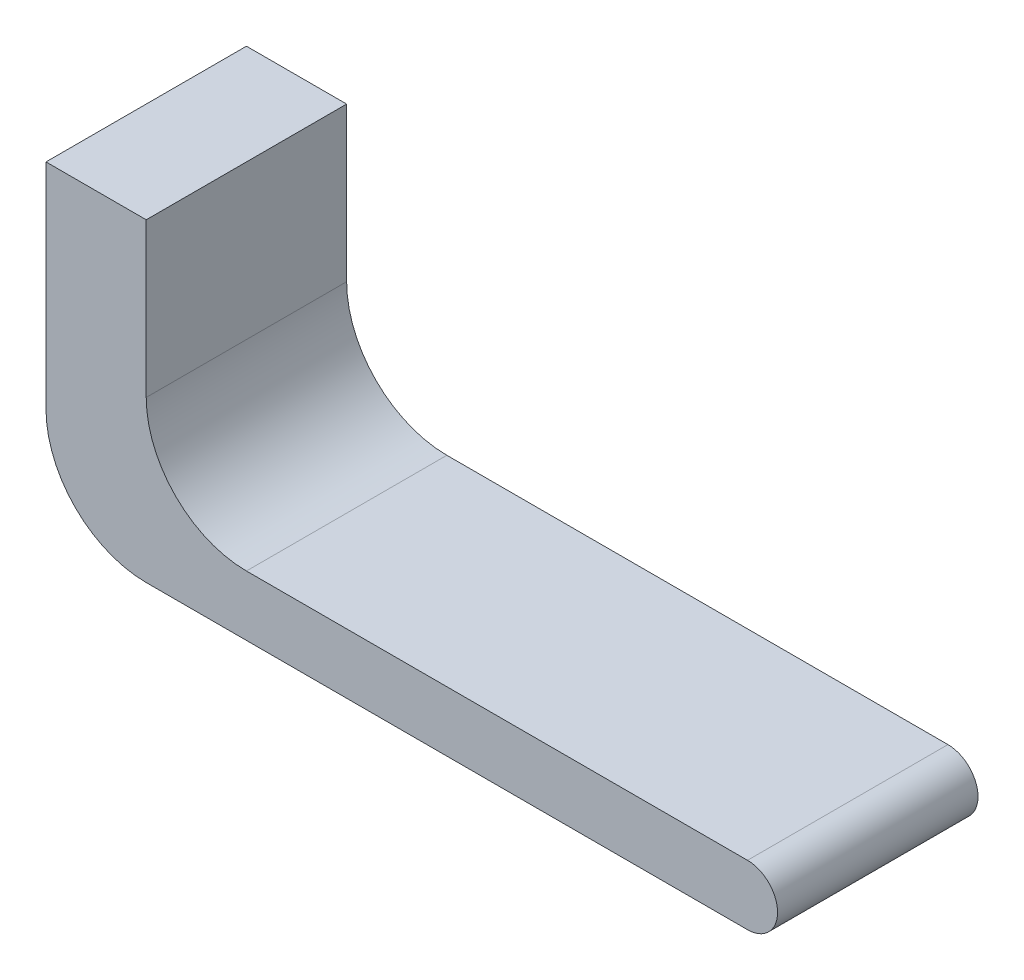
ISO-10303-21;
HEADER;
FILE_DESCRIPTION(('STEP AP214'),'2;1');
FILE_NAME('part.step','',(''),(''),'','','');
FILE_SCHEMA(('AUTOMOTIVE_DESIGN { 1 0 10303 214 1 1 1 1 }'));
ENDSEC;
DATA;
#1=APPLICATION_CONTEXT('core data for automotive mechanical design processes');
#2=APPLICATION_PROTOCOL_DEFINITION('international standard','automotive_design',2000,#1);
#3=PRODUCT_CONTEXT('',#1,'mechanical');
#4=PRODUCT('Part','Part','',(#3));
#5=PRODUCT_RELATED_PRODUCT_CATEGORY('part','',(#4));
#6=PRODUCT_DEFINITION_FORMATION('','',#4);
#7=PRODUCT_DEFINITION_CONTEXT('part definition',#1,'design');
#8=PRODUCT_DEFINITION('design','',#6,#7);
#9=PRODUCT_DEFINITION_SHAPE('','',#8);
#10=(LENGTH_UNIT() NAMED_UNIT(*) SI_UNIT(.MILLI.,.METRE.));
#11=(NAMED_UNIT(*) PLANE_ANGLE_UNIT() SI_UNIT($,.RADIAN.));
#12=(NAMED_UNIT(*) SI_UNIT($,.STERADIAN.) SOLID_ANGLE_UNIT());
#13=UNCERTAINTY_MEASURE_WITH_UNIT(LENGTH_MEASURE(1.E-05),#10,'distance_accuracy_value','');
#14=(GEOMETRIC_REPRESENTATION_CONTEXT(3) GLOBAL_UNCERTAINTY_ASSIGNED_CONTEXT((#13)) GLOBAL_UNIT_ASSIGNED_CONTEXT((#10,
#11,#12)) REPRESENTATION_CONTEXT('',''));
#15=CARTESIAN_POINT('',(0.,0.,0.));
#16=DIRECTION('',(0.,0.,1.));
#17=DIRECTION('',(1.,0.,0.));
#18=AXIS2_PLACEMENT_3D('',#15,#16,#17);
#19=CARTESIAN_POINT('',(0.,0.,10.));
#20=DIRECTION('',(0.,0.,-1.));
#21=DIRECTION('',(-1.,0.,0.));
#22=AXIS2_PLACEMENT_3D('',#19,#20,#21);
#23=CYLINDRICAL_SURFACE('',#22,1.5);
#24=CARTESIAN_POINT('',(0.,0.,0.));
#25=DIRECTION('',(0.,0.,1.));
#26=DIRECTION('',(1.,0.,0.));
#27=AXIS2_PLACEMENT_3D('',#24,#25,#26);
#28=CIRCLE('',#27,1.5);
#29=CARTESIAN_POINT('',(0.,-1.5,0.));
#30=VERTEX_POINT('',#29);
#31=CARTESIAN_POINT('',(0.,1.5,0.));
#32=VERTEX_POINT('',#31);
#33=EDGE_CURVE('E123',#30,#32,#28,.T.);
#34=ORIENTED_EDGE('',*,*,#33,.T.);
#35=DIRECTION('',(0.,0.,-1.));
#36=VECTOR('',#35,1.);
#37=CARTESIAN_POINT('',(0.,1.5,10.));
#38=LINE('',#37,#36);
#39=CARTESIAN_POINT('',(0.,1.5,10.));
#40=VERTEX_POINT('',#39);
#41=EDGE_CURVE('E104',#40,#32,#38,.T.);
#42=ORIENTED_EDGE('',*,*,#41,.F.);
#43=CARTESIAN_POINT('',(0.,0.,10.));
#44=DIRECTION('',(0.,0.,1.));
#45=DIRECTION('',(1.,0.,0.));
#46=AXIS2_PLACEMENT_3D('',#43,#44,#45);
#47=CIRCLE('',#46,1.5);
#48=CARTESIAN_POINT('',(0.,-1.5,10.));
#49=VERTEX_POINT('',#48);
#50=EDGE_CURVE('E111',#49,#40,#47,.T.);
#51=ORIENTED_EDGE('',*,*,#50,.F.);
#52=DIRECTION('',(0.,0.,-1.));
#53=VECTOR('',#52,1.);
#54=CARTESIAN_POINT('',(0.,-1.5,10.));
#55=LINE('',#54,#53);
#56=EDGE_CURVE('E140',#49,#30,#55,.T.);
#57=ORIENTED_EDGE('',*,*,#56,.T.);
#58=EDGE_LOOP('',(#34,#42,#51,#57));
#59=FACE_BOUND('',#58,.T.);
#60=ADVANCED_FACE('F35',(#59),#23,.T.);
#61=CARTESIAN_POINT('',(0.,1.5,10.));
#62=DIRECTION('',(0.,-1.,0.));
#63=DIRECTION('',(0.,0.,-1.));
#64=AXIS2_PLACEMENT_3D('',#61,#62,#63);
#65=PLANE('',#64);
#66=DIRECTION('',(-1.,0.,0.));
#67=VECTOR('',#66,1.);
#68=CARTESIAN_POINT('',(0.,1.5,0.));
#69=LINE('',#68,#67);
#70=CARTESIAN_POINT('',(-25.,1.5,0.));
#71=VERTEX_POINT('',#70);
#72=EDGE_CURVE('E151',#32,#71,#69,.T.);
#73=ORIENTED_EDGE('',*,*,#72,.T.);
#74=DIRECTION('',(0.,0.,-1.));
#75=VECTOR('',#74,1.);
#76=CARTESIAN_POINT('',(-25.,1.5,10.));
#77=LINE('',#76,#75);
#78=CARTESIAN_POINT('',(-25.,1.5,10.));
#79=VERTEX_POINT('',#78);
#80=EDGE_CURVE('E107',#79,#71,#77,.T.);
#81=ORIENTED_EDGE('',*,*,#80,.F.);
#82=DIRECTION('',(-1.,0.,0.));
#83=VECTOR('',#82,1.);
#84=CARTESIAN_POINT('',(0.,1.5,10.));
#85=LINE('',#84,#83);
#86=EDGE_CURVE('E100',#40,#79,#85,.T.);
#87=ORIENTED_EDGE('',*,*,#86,.F.);
#88=ORIENTED_EDGE('',*,*,#41,.T.);
#89=EDGE_LOOP('',(#73,#81,#87,#88));
#90=FACE_BOUND('',#89,.T.);
#91=ADVANCED_FACE('F102',(#90),#65,.F.);
#92=CARTESIAN_POINT('',(-25.,6.5,10.));
#93=DIRECTION('',(0.,0.,-1.));
#94=DIRECTION('',(-1.,0.,0.));
#95=AXIS2_PLACEMENT_3D('',#92,#93,#94);
#96=CYLINDRICAL_SURFACE('',#95,5.);
#97=CARTESIAN_POINT('',(-25.,6.5,0.));
#98=DIRECTION('',(0.,0.,-1.));
#99=DIRECTION('',(-1.,0.,0.));
#100=AXIS2_PLACEMENT_3D('',#97,#98,#99);
#101=CIRCLE('',#100,5.);
#102=CARTESIAN_POINT('',(-30.,6.50000000000004,0.));
#103=VERTEX_POINT('',#102);
#104=EDGE_CURVE('E149',#71,#103,#101,.T.);
#105=ORIENTED_EDGE('',*,*,#104,.T.);
#106=DIRECTION('',(0.,0.,-1.));
#107=VECTOR('',#106,1.);
#108=CARTESIAN_POINT('',(-30.,6.50000000000004,10.));
#109=LINE('',#108,#107);
#110=CARTESIAN_POINT('',(-30.,6.50000000000004,10.));
#111=VERTEX_POINT('',#110);
#112=EDGE_CURVE('E128',#111,#103,#109,.T.);
#113=ORIENTED_EDGE('',*,*,#112,.F.);
#114=CARTESIAN_POINT('',(-25.,6.5,10.));
#115=DIRECTION('',(0.,0.,-1.));
#116=DIRECTION('',(-1.,0.,0.));
#117=AXIS2_PLACEMENT_3D('',#114,#115,#116);
#118=CIRCLE('',#117,5.);
#119=EDGE_CURVE('E110',#79,#111,#118,.T.);
#120=ORIENTED_EDGE('',*,*,#119,.F.);
#121=ORIENTED_EDGE('',*,*,#80,.T.);
#122=EDGE_LOOP('',(#105,#113,#120,#121));
#123=FACE_BOUND('',#122,.T.);
#124=ADVANCED_FACE('F165',(#123),#96,.F.);
#125=CARTESIAN_POINT('',(-30.,6.50000000000004,10.));
#126=DIRECTION('',(-1.,0.,0.));
#127=DIRECTION('',(0.,0.,1.));
#128=AXIS2_PLACEMENT_3D('',#125,#126,#127);
#129=PLANE('',#128);
#130=DIRECTION('',(0.,1.,0.));
#131=VECTOR('',#130,1.);
#132=CARTESIAN_POINT('',(-30.,6.50000000000004,0.));
#133=LINE('',#132,#131);
#134=CARTESIAN_POINT('',(-30.,14.1760563380282,0.));
#135=VERTEX_POINT('',#134);
#136=EDGE_CURVE('E147',#103,#135,#133,.T.);
#137=ORIENTED_EDGE('',*,*,#136,.T.);
#138=DIRECTION('',(0.,0.,-1.));
#139=VECTOR('',#138,1.);
#140=CARTESIAN_POINT('',(-30.,14.1760563380282,10.));
#141=LINE('',#140,#139);
#142=CARTESIAN_POINT('',(-30.,14.1760563380282,10.));
#143=VERTEX_POINT('',#142);
#144=EDGE_CURVE('E134',#143,#135,#141,.T.);
#145=ORIENTED_EDGE('',*,*,#144,.F.);
#146=DIRECTION('',(0.,1.,0.));
#147=VECTOR('',#146,1.);
#148=CARTESIAN_POINT('',(-30.,6.50000000000004,10.));
#149=LINE('',#148,#147);
#150=EDGE_CURVE('E159',#111,#143,#149,.T.);
#151=ORIENTED_EDGE('',*,*,#150,.F.);
#152=ORIENTED_EDGE('',*,*,#112,.T.);
#153=EDGE_LOOP('',(#137,#145,#151,#152));
#154=FACE_BOUND('',#153,.T.);
#155=ADVANCED_FACE('F169',(#154),#129,.F.);
#156=CARTESIAN_POINT('',(-30.,14.1760563380282,10.));
#157=DIRECTION('',(0.,-1.,0.));
#158=DIRECTION('',(0.,0.,-1.));
#159=AXIS2_PLACEMENT_3D('',#156,#157,#158);
#160=PLANE('',#159);
#161=DIRECTION('',(-1.,0.,0.));
#162=VECTOR('',#161,1.);
#163=CARTESIAN_POINT('',(-30.,14.1760563380282,0.));
#164=LINE('',#163,#162);
#165=CARTESIAN_POINT('',(-35.,14.1760563380282,0.));
#166=VERTEX_POINT('',#165);
#167=EDGE_CURVE('E145',#135,#166,#164,.T.);
#168=ORIENTED_EDGE('',*,*,#167,.T.);
#169=DIRECTION('',(0.,0.,-1.));
#170=VECTOR('',#169,1.);
#171=CARTESIAN_POINT('',(-35.,14.1760563380282,10.));
#172=LINE('',#171,#170);
#173=CARTESIAN_POINT('',(-35.,14.1760563380282,10.));
#174=VERTEX_POINT('',#173);
#175=EDGE_CURVE('E137',#174,#166,#172,.T.);
#176=ORIENTED_EDGE('',*,*,#175,.F.);
#177=DIRECTION('',(-1.,0.,0.));
#178=VECTOR('',#177,1.);
#179=CARTESIAN_POINT('',(-30.,14.1760563380282,10.));
#180=LINE('',#179,#178);
#181=EDGE_CURVE('E157',#143,#174,#180,.T.);
#182=ORIENTED_EDGE('',*,*,#181,.F.);
#183=ORIENTED_EDGE('',*,*,#144,.T.);
#184=EDGE_LOOP('',(#168,#176,#182,#183));
#185=FACE_BOUND('',#184,.T.);
#186=ADVANCED_FACE('F174',(#185),#160,.F.);
#187=CARTESIAN_POINT('',(-35.,-1.5,10.));
#188=DIRECTION('',(1.,0.,0.));
#189=DIRECTION('',(0.,0.,-1.));
#190=AXIS2_PLACEMENT_3D('',#187,#188,#189);
#191=PLANE('',#190);
#192=DIRECTION('',(0.,-1.,0.));
#193=VECTOR('',#192,1.);
#194=CARTESIAN_POINT('',(-35.,-1.5,0.));
#195=LINE('',#194,#193);
#196=CARTESIAN_POINT('',(-35.,3.5,0.));
#197=VERTEX_POINT('',#196);
#198=EDGE_CURVE('E143',#166,#197,#195,.T.);
#199=ORIENTED_EDGE('',*,*,#198,.T.);
#200=DIRECTION('',(0.,0.,-1.));
#201=VECTOR('',#200,1.);
#202=CARTESIAN_POINT('',(-35.,3.5,10.));
#203=LINE('',#202,#201);
#204=CARTESIAN_POINT('',(-35.,3.5,10.));
#205=VERTEX_POINT('',#204);
#206=EDGE_CURVE('E43',#197,#205,#203,.F.);
#207=ORIENTED_EDGE('',*,*,#206,.T.);
#208=DIRECTION('',(0.,-1.,0.));
#209=VECTOR('',#208,1.);
#210=CARTESIAN_POINT('',(-35.,-1.5,10.));
#211=LINE('',#210,#209);
#212=EDGE_CURVE('E155',#174,#205,#211,.T.);
#213=ORIENTED_EDGE('',*,*,#212,.F.);
#214=ORIENTED_EDGE('',*,*,#175,.T.);
#215=EDGE_LOOP('',(#199,#207,#213,#214));
#216=FACE_BOUND('',#215,.T.);
#217=ADVANCED_FACE('F181',(#216),#191,.F.);
#218=CARTESIAN_POINT('',(0.,-1.5,10.));
#219=DIRECTION('',(0.,1.,0.));
#220=DIRECTION('',(0.,0.,1.));
#221=AXIS2_PLACEMENT_3D('',#218,#219,#220);
#222=PLANE('',#221);
#223=DIRECTION('',(1.,0.,0.));
#224=VECTOR('',#223,1.);
#225=CARTESIAN_POINT('',(-30.,-1.5,10.));
#226=LINE('',#225,#224);
#227=CARTESIAN_POINT('',(-30.,-1.5,10.));
#228=VERTEX_POINT('',#227);
#229=EDGE_CURVE('E116',#228,#49,#226,.T.);
#230=ORIENTED_EDGE('',*,*,#229,.F.);
#231=DIRECTION('',(0.,0.,-1.));
#232=VECTOR('',#231,1.);
#233=CARTESIAN_POINT('',(-30.,-1.5,10.));
#234=LINE('',#233,#232);
#235=CARTESIAN_POINT('',(-30.,-1.5,0.));
#236=VERTEX_POINT('',#235);
#237=EDGE_CURVE('E124',#228,#236,#234,.T.);
#238=ORIENTED_EDGE('',*,*,#237,.T.);
#239=DIRECTION('',(1.,0.,0.));
#240=VECTOR('',#239,1.);
#241=CARTESIAN_POINT('',(0.,-1.5,0.));
#242=LINE('',#241,#240);
#243=EDGE_CURVE('E120',#236,#30,#242,.T.);
#244=ORIENTED_EDGE('',*,*,#243,.T.);
#245=ORIENTED_EDGE('',*,*,#56,.F.);
#246=EDGE_LOOP('',(#230,#238,#244,#245));
#247=FACE_BOUND('',#246,.T.);
#248=ADVANCED_FACE('F179',(#247),#222,.F.);
#249=CARTESIAN_POINT('',(0.,0.,10.));
#250=DIRECTION('',(0.,0.,1.));
#251=DIRECTION('',(1.,0.,0.));
#252=AXIS2_PLACEMENT_3D('',#249,#250,#251);
#253=PLANE('',#252);
#254=ORIENTED_EDGE('',*,*,#212,.T.);
#255=CARTESIAN_POINT('',(-30.,3.5,10.));
#256=DIRECTION('',(0.,0.,1.));
#257=DIRECTION('',(1.,0.,0.));
#258=AXIS2_PLACEMENT_3D('',#255,#256,#257);
#259=CIRCLE('',#258,5.);
#260=EDGE_CURVE('E11',#205,#228,#259,.T.);
#261=ORIENTED_EDGE('',*,*,#260,.T.);
#262=ORIENTED_EDGE('',*,*,#229,.T.);
#263=ORIENTED_EDGE('',*,*,#50,.T.);
#264=ORIENTED_EDGE('',*,*,#86,.T.);
#265=ORIENTED_EDGE('',*,*,#119,.T.);
#266=ORIENTED_EDGE('',*,*,#150,.T.);
#267=ORIENTED_EDGE('',*,*,#181,.T.);
#268=EDGE_LOOP('',(#254,#261,#262,#263,#264,#265,#266,#267));
#269=FACE_BOUND('',#268,.T.);
#270=ADVANCED_FACE('F114',(#269),#253,.T.);
#271=CARTESIAN_POINT('',(0.,0.,0.));
#272=DIRECTION('',(0.,0.,1.));
#273=DIRECTION('',(1.,0.,0.));
#274=AXIS2_PLACEMENT_3D('',#271,#272,#273);
#275=PLANE('',#274);
#276=ORIENTED_EDGE('',*,*,#243,.F.);
#277=CARTESIAN_POINT('',(-30.,3.5,0.));
#278=DIRECTION('',(0.,0.,1.));
#279=DIRECTION('',(1.,0.,0.));
#280=AXIS2_PLACEMENT_3D('',#277,#278,#279);
#281=CIRCLE('',#280,5.);
#282=EDGE_CURVE('E57',#236,#197,#281,.F.);
#283=ORIENTED_EDGE('',*,*,#282,.T.);
#284=ORIENTED_EDGE('',*,*,#198,.F.);
#285=ORIENTED_EDGE('',*,*,#167,.F.);
#286=ORIENTED_EDGE('',*,*,#136,.F.);
#287=ORIENTED_EDGE('',*,*,#104,.F.);
#288=ORIENTED_EDGE('',*,*,#72,.F.);
#289=ORIENTED_EDGE('',*,*,#33,.F.);
#290=EDGE_LOOP('',(#276,#283,#284,#285,#286,#287,#288,#289));
#291=FACE_BOUND('',#290,.T.);
#292=ADVANCED_FACE('F180',(#291),#275,.F.);
#293=CARTESIAN_POINT('',(-30.,3.5,10.));
#294=DIRECTION('',(0.,0.,-1.));
#295=DIRECTION('',(-1.,0.,0.));
#296=AXIS2_PLACEMENT_3D('',#293,#294,#295);
#297=CYLINDRICAL_SURFACE('',#296,5.);
#298=ORIENTED_EDGE('',*,*,#260,.F.);
#299=ORIENTED_EDGE('',*,*,#206,.F.);
#300=ORIENTED_EDGE('',*,*,#282,.F.);
#301=ORIENTED_EDGE('',*,*,#237,.F.);
#302=EDGE_LOOP('',(#298,#299,#300,#301));
#303=FACE_BOUND('',#302,.T.);
#304=ADVANCED_FACE('F37',(#303),#297,.T.);
#305=CLOSED_SHELL('',(#60,#91,#124,#155,#186,#217,#248,#270,#292,#304));
#306=MANIFOLD_SOLID_BREP('B2',#305);
#307=ADVANCED_BREP_SHAPE_REPRESENTATION('',(#18,#306),#14);
#308=SHAPE_DEFINITION_REPRESENTATION(#9,#307);
ENDSEC;
END-ISO-10303-21;
